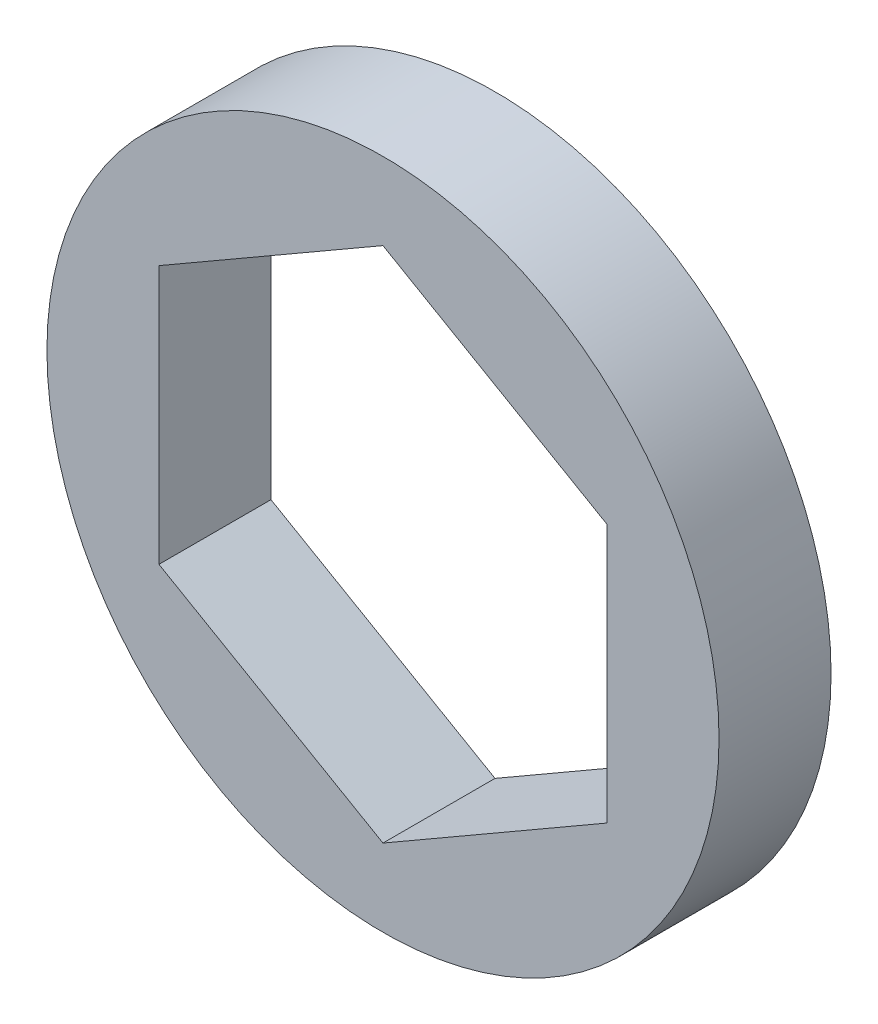
ISO-10303-21;
HEADER;
FILE_DESCRIPTION(('STEP AP214'),'2;1');
FILE_NAME('part.step','',(''),(''),'','','');
FILE_SCHEMA(('AUTOMOTIVE_DESIGN { 1 0 10303 214 1 1 1 1 }'));
ENDSEC;
DATA;
#1=APPLICATION_CONTEXT('core data for automotive mechanical design processes');
#2=APPLICATION_PROTOCOL_DEFINITION('international standard','automotive_design',2000,#1);
#3=PRODUCT_CONTEXT('',#1,'mechanical');
#4=PRODUCT('Part','Part','',(#3));
#5=PRODUCT_RELATED_PRODUCT_CATEGORY('part','',(#4));
#6=PRODUCT_DEFINITION_FORMATION('','',#4);
#7=PRODUCT_DEFINITION_CONTEXT('part definition',#1,'design');
#8=PRODUCT_DEFINITION('design','',#6,#7);
#9=PRODUCT_DEFINITION_SHAPE('','',#8);
#10=(LENGTH_UNIT() NAMED_UNIT(*) SI_UNIT(.MILLI.,.METRE.));
#11=(NAMED_UNIT(*) PLANE_ANGLE_UNIT() SI_UNIT($,.RADIAN.));
#12=(NAMED_UNIT(*) SI_UNIT($,.STERADIAN.) SOLID_ANGLE_UNIT());
#13=UNCERTAINTY_MEASURE_WITH_UNIT(LENGTH_MEASURE(1.E-05),#10,'distance_accuracy_value','');
#14=(GEOMETRIC_REPRESENTATION_CONTEXT(3) GLOBAL_UNCERTAINTY_ASSIGNED_CONTEXT((#13)) GLOBAL_UNIT_ASSIGNED_CONTEXT((#10,
#11,#12)) REPRESENTATION_CONTEXT('',''));
#15=CARTESIAN_POINT('',(0.,0.,0.));
#16=DIRECTION('',(0.,0.,1.));
#17=DIRECTION('',(1.,0.,0.));
#18=AXIS2_PLACEMENT_3D('',#15,#16,#17);
#19=CARTESIAN_POINT('',(0.,0.,3.175));
#20=DIRECTION('',(0.,0.,1.));
#21=DIRECTION('',(1.,0.,0.));
#22=AXIS2_PLACEMENT_3D('',#19,#20,#21);
#23=PLANE('',#22);
#24=CARTESIAN_POINT('',(0.,0.,3.175));
#25=DIRECTION('',(0.,0.,1.));
#26=DIRECTION('',(1.,0.,0.));
#27=AXIS2_PLACEMENT_3D('',#24,#25,#26);
#28=CIRCLE('',#27,19.05);
#29=CARTESIAN_POINT('',(19.05,0.,3.175));
#30=VERTEX_POINT('',#29);
#31=EDGE_CURVE('E11',#30,#30,#28,.T.);
#32=ORIENTED_EDGE('',*,*,#31,.T.);
#33=EDGE_LOOP('',(#32));
#34=FACE_BOUND('',#33,.T.);
#35=DIRECTION('',(-0.866025403784439,-0.5,0.));
#36=VECTOR('',#35,1.);
#37=CARTESIAN_POINT('',(0.,14.6646968374165,3.175));
#38=LINE('',#37,#36);
#39=CARTESIAN_POINT('',(0.,14.6646968374165,3.175));
#40=VERTEX_POINT('',#39);
#41=CARTESIAN_POINT('',(-12.7,7.33234841870825,3.175));
#42=VERTEX_POINT('',#41);
#43=EDGE_CURVE('E93',#40,#42,#38,.T.);
#44=ORIENTED_EDGE('',*,*,#43,.F.);
#45=DIRECTION('',(-0.866025403784439,0.5,0.));
#46=VECTOR('',#45,1.);
#47=CARTESIAN_POINT('',(12.7,7.33234841870825,3.175));
#48=LINE('',#47,#46);
#49=CARTESIAN_POINT('',(12.7,7.33234841870825,3.175));
#50=VERTEX_POINT('',#49);
#51=EDGE_CURVE('E85',#50,#40,#48,.T.);
#52=ORIENTED_EDGE('',*,*,#51,.F.);
#53=DIRECTION('',(0.,1.,0.));
#54=VECTOR('',#53,1.);
#55=CARTESIAN_POINT('',(12.7,-7.33234841870825,3.175));
#56=LINE('',#55,#54);
#57=CARTESIAN_POINT('',(12.7,-7.33234841870825,3.175));
#58=VERTEX_POINT('',#57);
#59=EDGE_CURVE('E113',#58,#50,#56,.T.);
#60=ORIENTED_EDGE('',*,*,#59,.F.);
#61=DIRECTION('',(0.866025403784439,0.5,0.));
#62=VECTOR('',#61,1.);
#63=CARTESIAN_POINT('',(0.,-14.6646968374165,3.175));
#64=LINE('',#63,#62);
#65=CARTESIAN_POINT('',(0.,-14.6646968374165,3.175));
#66=VERTEX_POINT('',#65);
#67=EDGE_CURVE('E111',#66,#58,#64,.T.);
#68=ORIENTED_EDGE('',*,*,#67,.F.);
#69=DIRECTION('',(0.866025403784439,-0.5,0.));
#70=VECTOR('',#69,1.);
#71=CARTESIAN_POINT('',(-12.7,-7.33234841870825,3.175));
#72=LINE('',#71,#70);
#73=CARTESIAN_POINT('',(-12.7,-7.33234841870825,3.175));
#74=VERTEX_POINT('',#73);
#75=EDGE_CURVE('E107',#74,#66,#72,.T.);
#76=ORIENTED_EDGE('',*,*,#75,.F.);
#77=DIRECTION('',(0.,-1.,0.));
#78=VECTOR('',#77,1.);
#79=CARTESIAN_POINT('',(-12.7,7.33234841870825,3.175));
#80=LINE('',#79,#78);
#81=EDGE_CURVE('E105',#42,#74,#80,.T.);
#82=ORIENTED_EDGE('',*,*,#81,.F.);
#83=EDGE_LOOP('',(#44,#52,#60,#68,#76,#82));
#84=FACE_BOUND('',#83,.T.);
#85=ADVANCED_FACE('F32',(#34,#84),#23,.T.);
#86=CARTESIAN_POINT('',(0.,0.,-3.175));
#87=DIRECTION('',(0.,0.,1.));
#88=DIRECTION('',(1.,0.,0.));
#89=AXIS2_PLACEMENT_3D('',#86,#87,#88);
#90=PLANE('',#89);
#91=CARTESIAN_POINT('',(0.,0.,-3.175));
#92=DIRECTION('',(0.,0.,1.));
#93=DIRECTION('',(1.,0.,0.));
#94=AXIS2_PLACEMENT_3D('',#91,#92,#93);
#95=CIRCLE('',#94,19.05);
#96=CARTESIAN_POINT('',(19.05,0.,-3.175));
#97=VERTEX_POINT('',#96);
#98=EDGE_CURVE('E36',#97,#97,#95,.T.);
#99=ORIENTED_EDGE('',*,*,#98,.F.);
#100=EDGE_LOOP('',(#99));
#101=FACE_BOUND('',#100,.T.);
#102=DIRECTION('',(-0.866025403784439,0.5,0.));
#103=VECTOR('',#102,1.);
#104=CARTESIAN_POINT('',(12.7,7.33234841870825,-3.175));
#105=LINE('',#104,#103);
#106=CARTESIAN_POINT('',(12.7,7.33234841870825,-3.175));
#107=VERTEX_POINT('',#106);
#108=CARTESIAN_POINT('',(0.,14.6646968374165,-3.175));
#109=VERTEX_POINT('',#108);
#110=EDGE_CURVE('E55',#107,#109,#105,.T.);
#111=ORIENTED_EDGE('',*,*,#110,.T.);
#112=DIRECTION('',(-0.866025403784439,-0.5,0.));
#113=VECTOR('',#112,1.);
#114=CARTESIAN_POINT('',(0.,14.6646968374165,-3.175));
#115=LINE('',#114,#113);
#116=CARTESIAN_POINT('',(-12.7,7.33234841870825,-3.175));
#117=VERTEX_POINT('',#116);
#118=EDGE_CURVE('E100',#109,#117,#115,.T.);
#119=ORIENTED_EDGE('',*,*,#118,.T.);
#120=DIRECTION('',(0.,-1.,0.));
#121=VECTOR('',#120,1.);
#122=CARTESIAN_POINT('',(-12.7,7.33234841870825,-3.175));
#123=LINE('',#122,#121);
#124=CARTESIAN_POINT('',(-12.7,-7.33234841870825,-3.175));
#125=VERTEX_POINT('',#124);
#126=EDGE_CURVE('E117',#117,#125,#123,.T.);
#127=ORIENTED_EDGE('',*,*,#126,.T.);
#128=DIRECTION('',(0.866025403784439,-0.5,0.));
#129=VECTOR('',#128,1.);
#130=CARTESIAN_POINT('',(-12.7,-7.33234841870825,-3.175));
#131=LINE('',#130,#129);
#132=CARTESIAN_POINT('',(0.,-14.6646968374165,-3.175));
#133=VERTEX_POINT('',#132);
#134=EDGE_CURVE('E120',#125,#133,#131,.T.);
#135=ORIENTED_EDGE('',*,*,#134,.T.);
#136=DIRECTION('',(0.866025403784439,0.5,0.));
#137=VECTOR('',#136,1.);
#138=CARTESIAN_POINT('',(0.,-14.6646968374165,-3.175));
#139=LINE('',#138,#137);
#140=CARTESIAN_POINT('',(12.7,-7.33234841870825,-3.175));
#141=VERTEX_POINT('',#140);
#142=EDGE_CURVE('E123',#133,#141,#139,.T.);
#143=ORIENTED_EDGE('',*,*,#142,.T.);
#144=DIRECTION('',(0.,1.,0.));
#145=VECTOR('',#144,1.);
#146=CARTESIAN_POINT('',(12.7,-7.33234841870825,-3.175));
#147=LINE('',#146,#145);
#148=EDGE_CURVE('E94',#141,#107,#147,.T.);
#149=ORIENTED_EDGE('',*,*,#148,.T.);
#150=EDGE_LOOP('',(#111,#119,#127,#135,#143,#149));
#151=FACE_BOUND('',#150,.T.);
#152=ADVANCED_FACE('F140',(#101,#151),#90,.F.);
#153=CARTESIAN_POINT('',(0.,0.,3.175));
#154=DIRECTION('',(0.,0.,-1.));
#155=DIRECTION('',(-1.,0.,0.));
#156=AXIS2_PLACEMENT_3D('',#153,#154,#155);
#157=CYLINDRICAL_SURFACE('',#156,19.05);
#158=ORIENTED_EDGE('',*,*,#31,.F.);
#159=EDGE_LOOP('',(#158));
#160=FACE_BOUND('',#159,.T.);
#161=ORIENTED_EDGE('',*,*,#98,.T.);
#162=EDGE_LOOP('',(#161));
#163=FACE_BOUND('',#162,.T.);
#164=ADVANCED_FACE('F34',(#160,#163),#157,.T.);
#165=CARTESIAN_POINT('',(12.7,7.33234841870825,3.175));
#166=DIRECTION('',(-0.5,-0.866025403784439,0.));
#167=DIRECTION('',(0.866025403784439,-0.5,0.));
#168=AXIS2_PLACEMENT_3D('',#165,#166,#167);
#169=PLANE('',#168);
#170=ORIENTED_EDGE('',*,*,#110,.F.);
#171=DIRECTION('',(0.,0.,-1.));
#172=VECTOR('',#171,1.);
#173=CARTESIAN_POINT('',(12.7,7.33234841870825,3.175));
#174=LINE('',#173,#172);
#175=EDGE_CURVE('E89',#50,#107,#174,.T.);
#176=ORIENTED_EDGE('',*,*,#175,.F.);
#177=ORIENTED_EDGE('',*,*,#51,.T.);
#178=DIRECTION('',(0.,0.,-1.));
#179=VECTOR('',#178,1.);
#180=CARTESIAN_POINT('',(0.,14.6646968374165,3.175));
#181=LINE('',#180,#179);
#182=EDGE_CURVE('E88',#40,#109,#181,.T.);
#183=ORIENTED_EDGE('',*,*,#182,.T.);
#184=EDGE_LOOP('',(#170,#176,#177,#183));
#185=FACE_BOUND('',#184,.T.);
#186=ADVANCED_FACE('F87',(#185),#169,.T.);
#187=CARTESIAN_POINT('',(0.,14.6646968374165,3.175));
#188=DIRECTION('',(0.5,-0.866025403784438,0.));
#189=DIRECTION('',(0.866025403784439,0.5,0.));
#190=AXIS2_PLACEMENT_3D('',#187,#188,#189);
#191=PLANE('',#190);
#192=ORIENTED_EDGE('',*,*,#118,.F.);
#193=ORIENTED_EDGE('',*,*,#182,.F.);
#194=ORIENTED_EDGE('',*,*,#43,.T.);
#195=DIRECTION('',(0.,0.,-1.));
#196=VECTOR('',#195,1.);
#197=CARTESIAN_POINT('',(-12.7,7.33234841870825,3.175));
#198=LINE('',#197,#196);
#199=EDGE_CURVE('E101',#42,#117,#198,.T.);
#200=ORIENTED_EDGE('',*,*,#199,.T.);
#201=EDGE_LOOP('',(#192,#193,#194,#200));
#202=FACE_BOUND('',#201,.T.);
#203=ADVANCED_FACE('F97',(#202),#191,.T.);
#204=CARTESIAN_POINT('',(-12.7,7.33234841870825,3.175));
#205=DIRECTION('',(1.,0.,0.));
#206=DIRECTION('',(0.,0.,-1.));
#207=AXIS2_PLACEMENT_3D('',#204,#205,#206);
#208=PLANE('',#207);
#209=ORIENTED_EDGE('',*,*,#126,.F.);
#210=ORIENTED_EDGE('',*,*,#199,.F.);
#211=ORIENTED_EDGE('',*,*,#81,.T.);
#212=DIRECTION('',(0.,0.,-1.));
#213=VECTOR('',#212,1.);
#214=CARTESIAN_POINT('',(-12.7,-7.33234841870825,3.175));
#215=LINE('',#214,#213);
#216=EDGE_CURVE('E132',#74,#125,#215,.T.);
#217=ORIENTED_EDGE('',*,*,#216,.T.);
#218=EDGE_LOOP('',(#209,#210,#211,#217));
#219=FACE_BOUND('',#218,.T.);
#220=ADVANCED_FACE('F136',(#219),#208,.T.);
#221=CARTESIAN_POINT('',(-12.7,-7.33234841870825,3.175));
#222=DIRECTION('',(0.5,0.866025403784439,0.));
#223=DIRECTION('',(-0.866025403784439,0.5,0.));
#224=AXIS2_PLACEMENT_3D('',#221,#222,#223);
#225=PLANE('',#224);
#226=ORIENTED_EDGE('',*,*,#134,.F.);
#227=ORIENTED_EDGE('',*,*,#216,.F.);
#228=ORIENTED_EDGE('',*,*,#75,.T.);
#229=DIRECTION('',(0.,0.,-1.));
#230=VECTOR('',#229,1.);
#231=CARTESIAN_POINT('',(0.,-14.6646968374165,3.175));
#232=LINE('',#231,#230);
#233=EDGE_CURVE('E130',#66,#133,#232,.T.);
#234=ORIENTED_EDGE('',*,*,#233,.T.);
#235=EDGE_LOOP('',(#226,#227,#228,#234));
#236=FACE_BOUND('',#235,.T.);
#237=ADVANCED_FACE('F148',(#236),#225,.T.);
#238=CARTESIAN_POINT('',(0.,-14.6646968374165,3.175));
#239=DIRECTION('',(-0.5,0.866025403784439,0.));
#240=DIRECTION('',(-0.866025403784439,-0.5,0.));
#241=AXIS2_PLACEMENT_3D('',#238,#239,#240);
#242=PLANE('',#241);
#243=ORIENTED_EDGE('',*,*,#142,.F.);
#244=ORIENTED_EDGE('',*,*,#233,.F.);
#245=ORIENTED_EDGE('',*,*,#67,.T.);
#246=DIRECTION('',(0.,0.,-1.));
#247=VECTOR('',#246,1.);
#248=CARTESIAN_POINT('',(12.7,-7.33234841870825,3.175));
#249=LINE('',#248,#247);
#250=EDGE_CURVE('E47',#58,#141,#249,.T.);
#251=ORIENTED_EDGE('',*,*,#250,.T.);
#252=EDGE_LOOP('',(#243,#244,#245,#251));
#253=FACE_BOUND('',#252,.T.);
#254=ADVANCED_FACE('F146',(#253),#242,.T.);
#255=CARTESIAN_POINT('',(12.7,-7.33234841870825,3.175));
#256=DIRECTION('',(-1.,0.,0.));
#257=DIRECTION('',(0.,-1.,0.));
#258=AXIS2_PLACEMENT_3D('',#255,#256,#257);
#259=PLANE('',#258);
#260=ORIENTED_EDGE('',*,*,#148,.F.);
#261=ORIENTED_EDGE('',*,*,#250,.F.);
#262=ORIENTED_EDGE('',*,*,#59,.T.);
#263=ORIENTED_EDGE('',*,*,#175,.T.);
#264=EDGE_LOOP('',(#260,#261,#262,#263));
#265=FACE_BOUND('',#264,.T.);
#266=ADVANCED_FACE('F142',(#265),#259,.T.);
#267=CLOSED_SHELL('',(#85,#152,#164,#186,#203,#220,#237,#254,#266));
#268=MANIFOLD_SOLID_BREP('B2',#267);
#269=ADVANCED_BREP_SHAPE_REPRESENTATION('',(#18,#268),#14);
#270=SHAPE_DEFINITION_REPRESENTATION(#9,#269);
ENDSEC;
END-ISO-10303-21;
